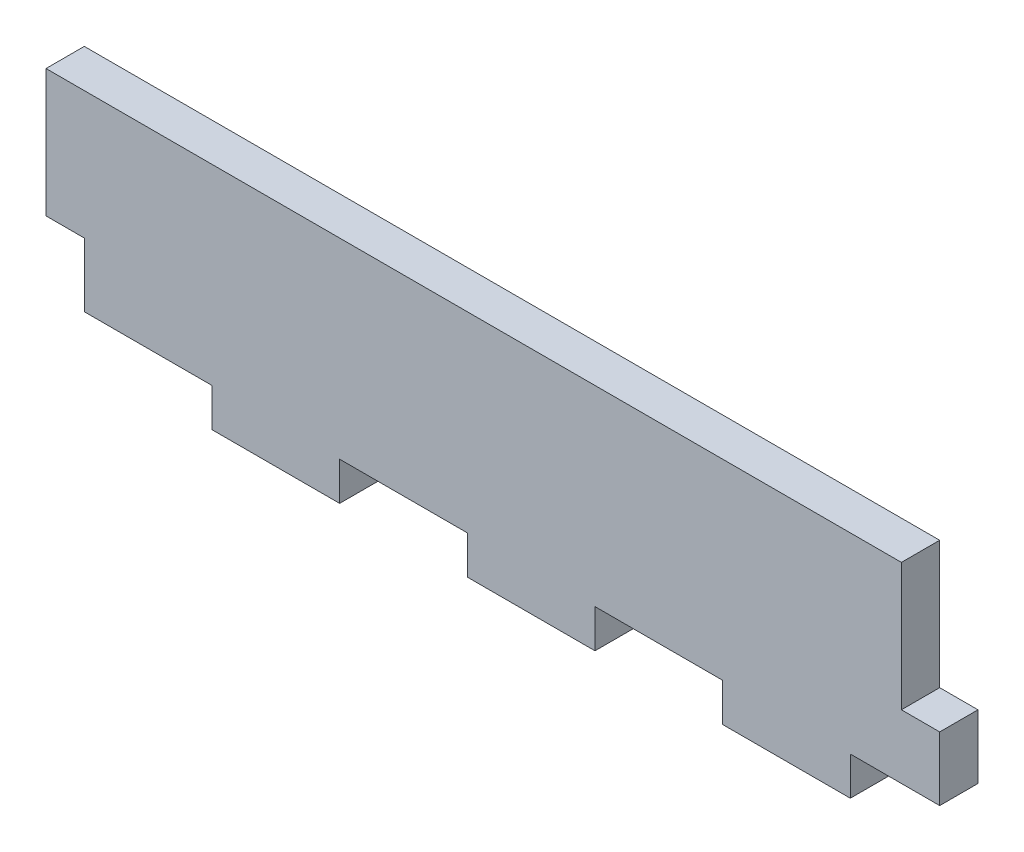
ISO-10303-21;
HEADER;
FILE_DESCRIPTION(('STEP AP214'),'2;1');
FILE_NAME('part.step','',(''),(''),'','','');
FILE_SCHEMA(('AUTOMOTIVE_DESIGN { 1 0 10303 214 1 1 1 1 }'));
ENDSEC;
DATA;
#1=APPLICATION_CONTEXT('core data for automotive mechanical design processes');
#2=APPLICATION_PROTOCOL_DEFINITION('international standard','automotive_design',2000,#1);
#3=PRODUCT_CONTEXT('',#1,'mechanical');
#4=PRODUCT('Part','Part','',(#3));
#5=PRODUCT_RELATED_PRODUCT_CATEGORY('part','',(#4));
#6=PRODUCT_DEFINITION_FORMATION('','',#4);
#7=PRODUCT_DEFINITION_CONTEXT('part definition',#1,'design');
#8=PRODUCT_DEFINITION('design','',#6,#7);
#9=PRODUCT_DEFINITION_SHAPE('','',#8);
#10=(LENGTH_UNIT() NAMED_UNIT(*) SI_UNIT(.MILLI.,.METRE.));
#11=(NAMED_UNIT(*) PLANE_ANGLE_UNIT() SI_UNIT($,.RADIAN.));
#12=(NAMED_UNIT(*) SI_UNIT($,.STERADIAN.) SOLID_ANGLE_UNIT());
#13=UNCERTAINTY_MEASURE_WITH_UNIT(LENGTH_MEASURE(1.E-05),#10,'distance_accuracy_value','');
#14=(GEOMETRIC_REPRESENTATION_CONTEXT(3) GLOBAL_UNCERTAINTY_ASSIGNED_CONTEXT((#13)) GLOBAL_UNIT_ASSIGNED_CONTEXT((#10,
#11,#12)) REPRESENTATION_CONTEXT('',''));
#15=CARTESIAN_POINT('',(0.,0.,0.));
#16=DIRECTION('',(0.,0.,1.));
#17=DIRECTION('',(1.,0.,0.));
#18=AXIS2_PLACEMENT_3D('',#15,#16,#17);
#19=CARTESIAN_POINT('',(0.,0.,3.));
#20=DIRECTION('',(1.,0.,0.));
#21=DIRECTION('',(0.,1.,0.));
#22=AXIS2_PLACEMENT_3D('',#19,#20,#21);
#23=PLANE('',#22);
#24=DIRECTION('',(0.,0.,1.));
#25=VECTOR('',#24,1.);
#26=CARTESIAN_POINT('',(0.,-10.,0.));
#27=LINE('',#26,#25);
#28=CARTESIAN_POINT('',(0.,-10.,0.));
#29=VERTEX_POINT('',#28);
#30=CARTESIAN_POINT('',(0.,-10.,3.));
#31=VERTEX_POINT('',#30);
#32=EDGE_CURVE('E47',#29,#31,#27,.T.);
#33=ORIENTED_EDGE('',*,*,#32,.F.);
#34=DIRECTION('',(0.,-1.,0.));
#35=VECTOR('',#34,1.);
#36=CARTESIAN_POINT('',(0.,0.,0.));
#37=LINE('',#36,#35);
#38=CARTESIAN_POINT('',(0.,-15.,0.));
#39=VERTEX_POINT('',#38);
#40=EDGE_CURVE('E193',#29,#39,#37,.T.);
#41=ORIENTED_EDGE('',*,*,#40,.T.);
#42=DIRECTION('',(0.,0.,1.));
#43=VECTOR('',#42,1.);
#44=CARTESIAN_POINT('',(0.,-15.,-7.));
#45=LINE('',#44,#43);
#46=CARTESIAN_POINT('',(0.,-15.,3.));
#47=VERTEX_POINT('',#46);
#48=EDGE_CURVE('E262',#39,#47,#45,.T.);
#49=ORIENTED_EDGE('',*,*,#48,.T.);
#50=DIRECTION('',(0.,-1.,0.));
#51=VECTOR('',#50,1.);
#52=CARTESIAN_POINT('',(0.,0.,3.));
#53=LINE('',#52,#51);
#54=EDGE_CURVE('E268',#31,#47,#53,.T.);
#55=ORIENTED_EDGE('',*,*,#54,.F.);
#56=EDGE_LOOP('',(#33,#41,#49,#55));
#57=FACE_BOUND('',#56,.T.);
#58=ADVANCED_FACE('F33',(#57),#23,.F.);
#59=CARTESIAN_POINT('',(0.,-18.,3.));
#60=DIRECTION('',(0.,1.,0.));
#61=DIRECTION('',(0.,0.,1.));
#62=AXIS2_PLACEMENT_3D('',#59,#60,#61);
#63=PLANE('',#62);
#64=DIRECTION('',(1.,0.,0.));
#65=VECTOR('',#64,1.);
#66=CARTESIAN_POINT('',(0.,-18.,0.));
#67=LINE('',#66,#65);
#68=CARTESIAN_POINT('',(10.,-18.,0.));
#69=VERTEX_POINT('',#68);
#70=CARTESIAN_POINT('',(20.,-18.,0.));
#71=VERTEX_POINT('',#70);
#72=EDGE_CURVE('E284',#69,#71,#67,.T.);
#73=ORIENTED_EDGE('',*,*,#72,.T.);
#74=DIRECTION('',(0.,0.,1.));
#75=VECTOR('',#74,1.);
#76=CARTESIAN_POINT('',(20.,-18.,-7.));
#77=LINE('',#76,#75);
#78=CARTESIAN_POINT('',(20.,-18.,3.));
#79=VERTEX_POINT('',#78);
#80=EDGE_CURVE('E218',#71,#79,#77,.T.);
#81=ORIENTED_EDGE('',*,*,#80,.T.);
#82=DIRECTION('',(1.,0.,0.));
#83=VECTOR('',#82,1.);
#84=CARTESIAN_POINT('',(0.,-18.,3.));
#85=LINE('',#84,#83);
#86=CARTESIAN_POINT('',(10.,-18.,3.));
#87=VERTEX_POINT('',#86);
#88=EDGE_CURVE('E272',#87,#79,#85,.T.);
#89=ORIENTED_EDGE('',*,*,#88,.F.);
#90=DIRECTION('',(0.,0.,1.));
#91=VECTOR('',#90,1.);
#92=CARTESIAN_POINT('',(10.,-18.,-7.));
#93=LINE('',#92,#91);
#94=EDGE_CURVE('E261',#69,#87,#93,.T.);
#95=ORIENTED_EDGE('',*,*,#94,.F.);
#96=EDGE_LOOP('',(#73,#81,#89,#95));
#97=FACE_BOUND('',#96,.T.);
#98=ADVANCED_FACE('F338',(#97),#63,.F.);
#99=CARTESIAN_POINT('',(30.,-18.,3.));
#100=VERTEX_POINT('',#99);
#101=CARTESIAN_POINT('',(40.,-18.,3.));
#102=VERTEX_POINT('',#101);
#103=EDGE_CURVE('E276',#100,#102,#85,.T.);
#104=ORIENTED_EDGE('',*,*,#103,.F.);
#105=DIRECTION('',(0.,0.,1.));
#106=VECTOR('',#105,1.);
#107=CARTESIAN_POINT('',(30.,-18.,-7.));
#108=LINE('',#107,#106);
#109=CARTESIAN_POINT('',(30.,-18.,0.));
#110=VERTEX_POINT('',#109);
#111=EDGE_CURVE('E224',#110,#100,#108,.T.);
#112=ORIENTED_EDGE('',*,*,#111,.F.);
#113=CARTESIAN_POINT('',(40.,-18.,0.));
#114=VERTEX_POINT('',#113);
#115=EDGE_CURVE('E288',#110,#114,#67,.T.);
#116=ORIENTED_EDGE('',*,*,#115,.T.);
#117=DIRECTION('',(0.,0.,1.));
#118=VECTOR('',#117,1.);
#119=CARTESIAN_POINT('',(40.,-18.,-7.));
#120=LINE('',#119,#118);
#121=EDGE_CURVE('E237',#114,#102,#120,.T.);
#122=ORIENTED_EDGE('',*,*,#121,.T.);
#123=EDGE_LOOP('',(#104,#112,#116,#122));
#124=FACE_BOUND('',#123,.T.);
#125=ADVANCED_FACE('F342',(#124),#63,.F.);
#126=CARTESIAN_POINT('',(50.,-18.,3.));
#127=VERTEX_POINT('',#126);
#128=CARTESIAN_POINT('',(60.,-18.,3.));
#129=VERTEX_POINT('',#128);
#130=EDGE_CURVE('E270',#127,#129,#85,.T.);
#131=ORIENTED_EDGE('',*,*,#130,.F.);
#132=DIRECTION('',(0.,0.,1.));
#133=VECTOR('',#132,1.);
#134=CARTESIAN_POINT('',(50.,-18.,-7.));
#135=LINE('',#134,#133);
#136=CARTESIAN_POINT('',(50.,-18.,0.));
#137=VERTEX_POINT('',#136);
#138=EDGE_CURVE('E241',#137,#127,#135,.T.);
#139=ORIENTED_EDGE('',*,*,#138,.F.);
#140=CARTESIAN_POINT('',(60.,-18.,0.));
#141=VERTEX_POINT('',#140);
#142=EDGE_CURVE('E283',#137,#141,#67,.T.);
#143=ORIENTED_EDGE('',*,*,#142,.T.);
#144=DIRECTION('',(0.,0.,1.));
#145=VECTOR('',#144,1.);
#146=CARTESIAN_POINT('',(60.,-18.,-7.));
#147=LINE('',#146,#145);
#148=EDGE_CURVE('E249',#141,#129,#147,.T.);
#149=ORIENTED_EDGE('',*,*,#148,.T.);
#150=EDGE_LOOP('',(#131,#139,#143,#149));
#151=FACE_BOUND('',#150,.T.);
#152=ADVANCED_FACE('F344',(#151),#63,.F.);
#153=CARTESIAN_POINT('',(67.,0.,3.));
#154=DIRECTION('',(-1.,0.,0.));
#155=DIRECTION('',(0.,0.,1.));
#156=AXIS2_PLACEMENT_3D('',#153,#154,#155);
#157=PLANE('',#156);
#158=DIRECTION('',(0.,1.,0.));
#159=VECTOR('',#158,1.);
#160=CARTESIAN_POINT('',(67.,0.,0.));
#161=LINE('',#160,#159);
#162=CARTESIAN_POINT('',(67.,-15.,0.));
#163=VERTEX_POINT('',#162);
#164=CARTESIAN_POINT('',(67.,-10.,0.));
#165=VERTEX_POINT('',#164);
#166=EDGE_CURVE('E287',#163,#165,#161,.T.);
#167=ORIENTED_EDGE('',*,*,#166,.T.);
#168=DIRECTION('',(0.,0.,1.));
#169=VECTOR('',#168,1.);
#170=CARTESIAN_POINT('',(67.,-10.,-7.));
#171=LINE('',#170,#169);
#172=CARTESIAN_POINT('',(67.,-10.,3.));
#173=VERTEX_POINT('',#172);
#174=EDGE_CURVE('E203',#165,#173,#171,.T.);
#175=ORIENTED_EDGE('',*,*,#174,.T.);
#176=DIRECTION('',(0.,1.,0.));
#177=VECTOR('',#176,1.);
#178=CARTESIAN_POINT('',(67.,0.,3.));
#179=LINE('',#178,#177);
#180=CARTESIAN_POINT('',(67.,-15.,3.));
#181=VERTEX_POINT('',#180);
#182=EDGE_CURVE('E275',#181,#173,#179,.T.);
#183=ORIENTED_EDGE('',*,*,#182,.F.);
#184=DIRECTION('',(0.,0.,-1.));
#185=VECTOR('',#184,1.);
#186=CARTESIAN_POINT('',(67.,-15.,3.));
#187=LINE('',#186,#185);
#188=EDGE_CURVE('E221',#181,#163,#187,.T.);
#189=ORIENTED_EDGE('',*,*,#188,.T.);
#190=EDGE_LOOP('',(#167,#175,#183,#189));
#191=FACE_BOUND('',#190,.T.);
#192=ADVANCED_FACE('F351',(#191),#157,.F.);
#193=CARTESIAN_POINT('',(0.,0.,3.));
#194=DIRECTION('',(0.,-1.,0.));
#195=DIRECTION('',(0.,0.,-1.));
#196=AXIS2_PLACEMENT_3D('',#193,#194,#195);
#197=PLANE('',#196);
#198=DIRECTION('',(-1.,0.,0.));
#199=VECTOR('',#198,1.);
#200=CARTESIAN_POINT('',(0.,0.,3.));
#201=LINE('',#200,#199);
#202=CARTESIAN_POINT('',(64.,0.,3.));
#203=VERTEX_POINT('',#202);
#204=CARTESIAN_POINT('',(-3.,0.,3.));
#205=VERTEX_POINT('',#204);
#206=EDGE_CURVE('E279',#203,#205,#201,.T.);
#207=ORIENTED_EDGE('',*,*,#206,.F.);
#208=DIRECTION('',(0.,0.,1.));
#209=VECTOR('',#208,1.);
#210=CARTESIAN_POINT('',(64.,0.,-7.));
#211=LINE('',#210,#209);
#212=CARTESIAN_POINT('',(64.,0.,0.));
#213=VERTEX_POINT('',#212);
#214=EDGE_CURVE('E202',#213,#203,#211,.T.);
#215=ORIENTED_EDGE('',*,*,#214,.F.);
#216=DIRECTION('',(-1.,0.,0.));
#217=VECTOR('',#216,1.);
#218=CARTESIAN_POINT('',(0.,0.,0.));
#219=LINE('',#218,#217);
#220=CARTESIAN_POINT('',(-3.,0.,0.));
#221=VERTEX_POINT('',#220);
#222=EDGE_CURVE('E271',#213,#221,#219,.T.);
#223=ORIENTED_EDGE('',*,*,#222,.T.);
#224=DIRECTION('',(0.,0.,-1.));
#225=VECTOR('',#224,1.);
#226=CARTESIAN_POINT('',(-3.,0.,0.));
#227=LINE('',#226,#225);
#228=EDGE_CURVE('E186',#205,#221,#227,.T.);
#229=ORIENTED_EDGE('',*,*,#228,.F.);
#230=EDGE_LOOP('',(#207,#215,#223,#229));
#231=FACE_BOUND('',#230,.T.);
#232=ADVANCED_FACE('F325',(#231),#197,.F.);
#233=CARTESIAN_POINT('',(0.,0.,3.));
#234=DIRECTION('',(0.,0.,1.));
#235=DIRECTION('',(1.,0.,0.));
#236=AXIS2_PLACEMENT_3D('',#233,#234,#235);
#237=PLANE('',#236);
#238=DIRECTION('',(1.,0.,0.));
#239=VECTOR('',#238,1.);
#240=CARTESIAN_POINT('',(67.,-10.,3.));
#241=LINE('',#240,#239);
#242=CARTESIAN_POINT('',(64.,-10.,3.));
#243=VERTEX_POINT('',#242);
#244=EDGE_CURVE('E196',#243,#173,#241,.T.);
#245=ORIENTED_EDGE('',*,*,#244,.F.);
#246=DIRECTION('',(0.,-1.,0.));
#247=VECTOR('',#246,1.);
#248=CARTESIAN_POINT('',(64.,0.,3.));
#249=LINE('',#248,#247);
#250=EDGE_CURVE('E194',#203,#243,#249,.T.);
#251=ORIENTED_EDGE('',*,*,#250,.F.);
#252=ORIENTED_EDGE('',*,*,#206,.T.);
#253=DIRECTION('',(0.,1.,0.));
#254=VECTOR('',#253,1.);
#255=CARTESIAN_POINT('',(-3.,0.,3.));
#256=LINE('',#255,#254);
#257=CARTESIAN_POINT('',(-3.,-10.,3.));
#258=VERTEX_POINT('',#257);
#259=EDGE_CURVE('E179',#258,#205,#256,.T.);
#260=ORIENTED_EDGE('',*,*,#259,.F.);
#261=DIRECTION('',(1.,0.,0.));
#262=VECTOR('',#261,1.);
#263=CARTESIAN_POINT('',(-3.,-10.,3.));
#264=LINE('',#263,#262);
#265=EDGE_CURVE('E175',#258,#31,#264,.T.);
#266=ORIENTED_EDGE('',*,*,#265,.T.);
#267=ORIENTED_EDGE('',*,*,#54,.T.);
#268=DIRECTION('',(-1.,0.,0.));
#269=VECTOR('',#268,1.);
#270=CARTESIAN_POINT('',(0.,-15.,3.));
#271=LINE('',#270,#269);
#272=CARTESIAN_POINT('',(10.,-15.,3.));
#273=VERTEX_POINT('',#272);
#274=EDGE_CURVE('E258',#273,#47,#271,.T.);
#275=ORIENTED_EDGE('',*,*,#274,.F.);
#276=DIRECTION('',(0.,1.,0.));
#277=VECTOR('',#276,1.);
#278=CARTESIAN_POINT('',(10.,-18.,3.));
#279=LINE('',#278,#277);
#280=EDGE_CURVE('E255',#87,#273,#279,.T.);
#281=ORIENTED_EDGE('',*,*,#280,.F.);
#282=ORIENTED_EDGE('',*,*,#88,.T.);
#283=DIRECTION('',(0.,-1.,0.));
#284=VECTOR('',#283,1.);
#285=CARTESIAN_POINT('',(20.,-18.,3.));
#286=LINE('',#285,#284);
#287=CARTESIAN_POINT('',(20.,-15.,3.));
#288=VERTEX_POINT('',#287);
#289=EDGE_CURVE('E209',#288,#79,#286,.T.);
#290=ORIENTED_EDGE('',*,*,#289,.F.);
#291=DIRECTION('',(-1.,0.,0.));
#292=VECTOR('',#291,1.);
#293=CARTESIAN_POINT('',(20.,-15.,3.));
#294=LINE('',#293,#292);
#295=CARTESIAN_POINT('',(30.,-15.,3.));
#296=VERTEX_POINT('',#295);
#297=EDGE_CURVE('E215',#296,#288,#294,.T.);
#298=ORIENTED_EDGE('',*,*,#297,.F.);
#299=DIRECTION('',(0.,1.,0.));
#300=VECTOR('',#299,1.);
#301=CARTESIAN_POINT('',(30.,-18.,3.));
#302=LINE('',#301,#300);
#303=EDGE_CURVE('E211',#100,#296,#302,.T.);
#304=ORIENTED_EDGE('',*,*,#303,.F.);
#305=ORIENTED_EDGE('',*,*,#103,.T.);
#306=DIRECTION('',(0.,-1.,0.));
#307=VECTOR('',#306,1.);
#308=CARTESIAN_POINT('',(40.,-18.,3.));
#309=LINE('',#308,#307);
#310=CARTESIAN_POINT('',(40.,-15.,3.));
#311=VERTEX_POINT('',#310);
#312=EDGE_CURVE('E228',#311,#102,#309,.T.);
#313=ORIENTED_EDGE('',*,*,#312,.F.);
#314=DIRECTION('',(-1.,0.,0.));
#315=VECTOR('',#314,1.);
#316=CARTESIAN_POINT('',(40.,-15.,3.));
#317=LINE('',#316,#315);
#318=CARTESIAN_POINT('',(50.,-15.,3.));
#319=VERTEX_POINT('',#318);
#320=EDGE_CURVE('E234',#319,#311,#317,.T.);
#321=ORIENTED_EDGE('',*,*,#320,.F.);
#322=DIRECTION('',(0.,1.,0.));
#323=VECTOR('',#322,1.);
#324=CARTESIAN_POINT('',(50.,-18.,3.));
#325=LINE('',#324,#323);
#326=EDGE_CURVE('E230',#127,#319,#325,.T.);
#327=ORIENTED_EDGE('',*,*,#326,.F.);
#328=ORIENTED_EDGE('',*,*,#130,.T.);
#329=DIRECTION('',(0.,-1.,0.));
#330=VECTOR('',#329,1.);
#331=CARTESIAN_POINT('',(60.,-18.,3.));
#332=LINE('',#331,#330);
#333=CARTESIAN_POINT('',(60.,-15.,3.));
#334=VERTEX_POINT('',#333);
#335=EDGE_CURVE('E206',#334,#129,#332,.T.);
#336=ORIENTED_EDGE('',*,*,#335,.F.);
#337=DIRECTION('',(-1.,0.,0.));
#338=VECTOR('',#337,1.);
#339=CARTESIAN_POINT('',(60.,-15.,3.));
#340=LINE('',#339,#338);
#341=EDGE_CURVE('E246',#181,#334,#340,.T.);
#342=ORIENTED_EDGE('',*,*,#341,.F.);
#343=ORIENTED_EDGE('',*,*,#182,.T.);
#344=EDGE_LOOP('',(#245,#251,#252,#260,#266,#267,#275,#281,#282,#290,#298,#304,#305,#313,#321,
#327,#328,#336,#342,#343));
#345=FACE_BOUND('',#344,.T.);
#346=ADVANCED_FACE('F328',(#345),#237,.T.);
#347=CARTESIAN_POINT('',(0.,0.,0.));
#348=DIRECTION('',(0.,0.,1.));
#349=DIRECTION('',(1.,0.,0.));
#350=AXIS2_PLACEMENT_3D('',#347,#348,#349);
#351=PLANE('',#350);
#352=DIRECTION('',(0.,-1.,0.));
#353=VECTOR('',#352,1.);
#354=CARTESIAN_POINT('',(64.,0.,0.));
#355=LINE('',#354,#353);
#356=CARTESIAN_POINT('',(64.,-10.,0.));
#357=VERTEX_POINT('',#356);
#358=EDGE_CURVE('E40',#213,#357,#355,.T.);
#359=ORIENTED_EDGE('',*,*,#358,.T.);
#360=DIRECTION('',(1.,0.,0.));
#361=VECTOR('',#360,1.);
#362=CARTESIAN_POINT('',(0.,-10.,0.));
#363=LINE('',#362,#361);
#364=EDGE_CURVE('E11',#357,#165,#363,.T.);
#365=ORIENTED_EDGE('',*,*,#364,.T.);
#366=ORIENTED_EDGE('',*,*,#166,.F.);
#367=DIRECTION('',(-1.,0.,0.));
#368=VECTOR('',#367,1.);
#369=CARTESIAN_POINT('',(0.,-15.,0.));
#370=LINE('',#369,#368);
#371=CARTESIAN_POINT('',(60.,-15.,0.));
#372=VERTEX_POINT('',#371);
#373=EDGE_CURVE('E296',#163,#372,#370,.T.);
#374=ORIENTED_EDGE('',*,*,#373,.T.);
#375=DIRECTION('',(0.,-1.,0.));
#376=VECTOR('',#375,1.);
#377=CARTESIAN_POINT('',(60.,0.,0.));
#378=LINE('',#377,#376);
#379=EDGE_CURVE('E299',#372,#141,#378,.T.);
#380=ORIENTED_EDGE('',*,*,#379,.T.);
#381=ORIENTED_EDGE('',*,*,#142,.F.);
#382=DIRECTION('',(0.,1.,0.));
#383=VECTOR('',#382,1.);
#384=CARTESIAN_POINT('',(50.,0.,0.));
#385=LINE('',#384,#383);
#386=CARTESIAN_POINT('',(50.,-15.,0.));
#387=VERTEX_POINT('',#386);
#388=EDGE_CURVE('E302',#137,#387,#385,.T.);
#389=ORIENTED_EDGE('',*,*,#388,.T.);
#390=DIRECTION('',(-1.,0.,0.));
#391=VECTOR('',#390,1.);
#392=CARTESIAN_POINT('',(0.,-15.,0.));
#393=LINE('',#392,#391);
#394=CARTESIAN_POINT('',(40.,-15.,0.));
#395=VERTEX_POINT('',#394);
#396=EDGE_CURVE('E305',#387,#395,#393,.T.);
#397=ORIENTED_EDGE('',*,*,#396,.T.);
#398=DIRECTION('',(0.,-1.,0.));
#399=VECTOR('',#398,1.);
#400=CARTESIAN_POINT('',(40.,0.,0.));
#401=LINE('',#400,#399);
#402=EDGE_CURVE('E308',#395,#114,#401,.T.);
#403=ORIENTED_EDGE('',*,*,#402,.T.);
#404=ORIENTED_EDGE('',*,*,#115,.F.);
#405=DIRECTION('',(0.,1.,0.));
#406=VECTOR('',#405,1.);
#407=CARTESIAN_POINT('',(30.,0.,0.));
#408=LINE('',#407,#406);
#409=CARTESIAN_POINT('',(30.,-15.,0.));
#410=VERTEX_POINT('',#409);
#411=EDGE_CURVE('E311',#110,#410,#408,.T.);
#412=ORIENTED_EDGE('',*,*,#411,.T.);
#413=DIRECTION('',(-1.,0.,0.));
#414=VECTOR('',#413,1.);
#415=CARTESIAN_POINT('',(0.,-15.,0.));
#416=LINE('',#415,#414);
#417=CARTESIAN_POINT('',(20.,-15.,0.));
#418=VERTEX_POINT('',#417);
#419=EDGE_CURVE('E314',#410,#418,#416,.T.);
#420=ORIENTED_EDGE('',*,*,#419,.T.);
#421=DIRECTION('',(0.,-1.,0.));
#422=VECTOR('',#421,1.);
#423=CARTESIAN_POINT('',(20.,0.,0.));
#424=LINE('',#423,#422);
#425=EDGE_CURVE('E317',#418,#71,#424,.T.);
#426=ORIENTED_EDGE('',*,*,#425,.T.);
#427=ORIENTED_EDGE('',*,*,#72,.F.);
#428=DIRECTION('',(0.,1.,0.));
#429=VECTOR('',#428,1.);
#430=CARTESIAN_POINT('',(10.,0.,0.));
#431=LINE('',#430,#429);
#432=CARTESIAN_POINT('',(10.,-15.,0.));
#433=VERTEX_POINT('',#432);
#434=EDGE_CURVE('E281',#69,#433,#431,.T.);
#435=ORIENTED_EDGE('',*,*,#434,.T.);
#436=DIRECTION('',(-1.,0.,0.));
#437=VECTOR('',#436,1.);
#438=CARTESIAN_POINT('',(0.,-15.,0.));
#439=LINE('',#438,#437);
#440=EDGE_CURVE('E294',#433,#39,#439,.T.);
#441=ORIENTED_EDGE('',*,*,#440,.T.);
#442=ORIENTED_EDGE('',*,*,#40,.F.);
#443=DIRECTION('',(1.,0.,0.));
#444=VECTOR('',#443,1.);
#445=CARTESIAN_POINT('',(-3.,-10.,0.));
#446=LINE('',#445,#444);
#447=CARTESIAN_POINT('',(-3.,-10.,0.));
#448=VERTEX_POINT('',#447);
#449=EDGE_CURVE('E173',#448,#29,#446,.T.);
#450=ORIENTED_EDGE('',*,*,#449,.F.);
#451=DIRECTION('',(0.,-1.,0.));
#452=VECTOR('',#451,1.);
#453=CARTESIAN_POINT('',(-3.,0.,0.));
#454=LINE('',#453,#452);
#455=EDGE_CURVE('E180',#221,#448,#454,.T.);
#456=ORIENTED_EDGE('',*,*,#455,.F.);
#457=ORIENTED_EDGE('',*,*,#222,.F.);
#458=EDGE_LOOP('',(#359,#365,#366,#374,#380,#381,#389,#397,#403,#404,#412,#420,#426,#427,#435,
#441,#442,#450,#456,#457));
#459=FACE_BOUND('',#458,.T.);
#460=ADVANCED_FACE('F191',(#459),#351,.F.);
#461=CARTESIAN_POINT('',(0.,-15.,-7.));
#462=DIRECTION('',(0.,1.,0.));
#463=DIRECTION('',(0.,0.,1.));
#464=AXIS2_PLACEMENT_3D('',#461,#462,#463);
#465=PLANE('',#464);
#466=DIRECTION('',(0.,0.,1.));
#467=VECTOR('',#466,1.);
#468=CARTESIAN_POINT('',(10.,-15.,-7.));
#469=LINE('',#468,#467);
#470=EDGE_CURVE('E265',#433,#273,#469,.T.);
#471=ORIENTED_EDGE('',*,*,#470,.T.);
#472=ORIENTED_EDGE('',*,*,#274,.T.);
#473=ORIENTED_EDGE('',*,*,#48,.F.);
#474=ORIENTED_EDGE('',*,*,#440,.F.);
#475=EDGE_LOOP('',(#471,#472,#473,#474));
#476=FACE_BOUND('',#475,.T.);
#477=ADVANCED_FACE('F335',(#476),#465,.F.);
#478=CARTESIAN_POINT('',(10.,-18.,-7.));
#479=DIRECTION('',(1.,0.,0.));
#480=DIRECTION('',(0.,0.,-1.));
#481=AXIS2_PLACEMENT_3D('',#478,#479,#480);
#482=PLANE('',#481);
#483=ORIENTED_EDGE('',*,*,#94,.T.);
#484=ORIENTED_EDGE('',*,*,#280,.T.);
#485=ORIENTED_EDGE('',*,*,#470,.F.);
#486=ORIENTED_EDGE('',*,*,#434,.F.);
#487=EDGE_LOOP('',(#483,#484,#485,#486));
#488=FACE_BOUND('',#487,.T.);
#489=ADVANCED_FACE('F402',(#488),#482,.F.);
#490=CARTESIAN_POINT('',(60.,-18.,-7.));
#491=DIRECTION('',(-1.,0.,0.));
#492=DIRECTION('',(0.,-1.,0.));
#493=AXIS2_PLACEMENT_3D('',#490,#491,#492);
#494=PLANE('',#493);
#495=DIRECTION('',(0.,0.,1.));
#496=VECTOR('',#495,1.);
#497=CARTESIAN_POINT('',(60.,-15.,-7.));
#498=LINE('',#497,#496);
#499=EDGE_CURVE('E231',#372,#334,#498,.T.);
#500=ORIENTED_EDGE('',*,*,#499,.T.);
#501=ORIENTED_EDGE('',*,*,#335,.T.);
#502=ORIENTED_EDGE('',*,*,#148,.F.);
#503=ORIENTED_EDGE('',*,*,#379,.F.);
#504=EDGE_LOOP('',(#500,#501,#502,#503));
#505=FACE_BOUND('',#504,.T.);
#506=ADVANCED_FACE('F398',(#505),#494,.F.);
#507=CARTESIAN_POINT('',(60.,-15.,-7.));
#508=DIRECTION('',(0.,1.,0.));
#509=DIRECTION('',(0.,0.,1.));
#510=AXIS2_PLACEMENT_3D('',#507,#508,#509);
#511=PLANE('',#510);
#512=ORIENTED_EDGE('',*,*,#341,.T.);
#513=ORIENTED_EDGE('',*,*,#499,.F.);
#514=ORIENTED_EDGE('',*,*,#373,.F.);
#515=ORIENTED_EDGE('',*,*,#188,.F.);
#516=EDGE_LOOP('',(#512,#513,#514,#515));
#517=FACE_BOUND('',#516,.T.);
#518=ADVANCED_FACE('F395',(#517),#511,.F.);
#519=CARTESIAN_POINT('',(40.,-18.,-7.));
#520=DIRECTION('',(-1.,0.,0.));
#521=DIRECTION('',(0.,-1.,0.));
#522=AXIS2_PLACEMENT_3D('',#519,#520,#521);
#523=PLANE('',#522);
#524=DIRECTION('',(0.,0.,1.));
#525=VECTOR('',#524,1.);
#526=CARTESIAN_POINT('',(40.,-15.,-7.));
#527=LINE('',#526,#525);
#528=EDGE_CURVE('E212',#395,#311,#527,.T.);
#529=ORIENTED_EDGE('',*,*,#528,.T.);
#530=ORIENTED_EDGE('',*,*,#312,.T.);
#531=ORIENTED_EDGE('',*,*,#121,.F.);
#532=ORIENTED_EDGE('',*,*,#402,.F.);
#533=EDGE_LOOP('',(#529,#530,#531,#532));
#534=FACE_BOUND('',#533,.T.);
#535=ADVANCED_FACE('F374',(#534),#523,.F.);
#536=CARTESIAN_POINT('',(40.,-15.,-7.));
#537=DIRECTION('',(0.,1.,0.));
#538=DIRECTION('',(0.,0.,1.));
#539=AXIS2_PLACEMENT_3D('',#536,#537,#538);
#540=PLANE('',#539);
#541=DIRECTION('',(0.,0.,1.));
#542=VECTOR('',#541,1.);
#543=CARTESIAN_POINT('',(50.,-15.,-7.));
#544=LINE('',#543,#542);
#545=EDGE_CURVE('E239',#387,#319,#544,.T.);
#546=ORIENTED_EDGE('',*,*,#545,.T.);
#547=ORIENTED_EDGE('',*,*,#320,.T.);
#548=ORIENTED_EDGE('',*,*,#528,.F.);
#549=ORIENTED_EDGE('',*,*,#396,.F.);
#550=EDGE_LOOP('',(#546,#547,#548,#549));
#551=FACE_BOUND('',#550,.T.);
#552=ADVANCED_FACE('F378',(#551),#540,.F.);
#553=CARTESIAN_POINT('',(50.,-18.,-7.));
#554=DIRECTION('',(1.,0.,0.));
#555=DIRECTION('',(0.,0.,-1.));
#556=AXIS2_PLACEMENT_3D('',#553,#554,#555);
#557=PLANE('',#556);
#558=ORIENTED_EDGE('',*,*,#138,.T.);
#559=ORIENTED_EDGE('',*,*,#326,.T.);
#560=ORIENTED_EDGE('',*,*,#545,.F.);
#561=ORIENTED_EDGE('',*,*,#388,.F.);
#562=EDGE_LOOP('',(#558,#559,#560,#561));
#563=FACE_BOUND('',#562,.T.);
#564=ADVANCED_FACE('F380',(#563),#557,.F.);
#565=CARTESIAN_POINT('',(20.,-18.,-7.));
#566=DIRECTION('',(-1.,0.,0.));
#567=DIRECTION('',(0.,-1.,0.));
#568=AXIS2_PLACEMENT_3D('',#565,#566,#567);
#569=PLANE('',#568);
#570=DIRECTION('',(0.,0.,1.));
#571=VECTOR('',#570,1.);
#572=CARTESIAN_POINT('',(20.,-15.,-7.));
#573=LINE('',#572,#571);
#574=EDGE_CURVE('E219',#418,#288,#573,.T.);
#575=ORIENTED_EDGE('',*,*,#574,.T.);
#576=ORIENTED_EDGE('',*,*,#289,.T.);
#577=ORIENTED_EDGE('',*,*,#80,.F.);
#578=ORIENTED_EDGE('',*,*,#425,.F.);
#579=EDGE_LOOP('',(#575,#576,#577,#578));
#580=FACE_BOUND('',#579,.T.);
#581=ADVANCED_FACE('F382',(#580),#569,.F.);
#582=CARTESIAN_POINT('',(20.,-15.,-7.));
#583=DIRECTION('',(0.,1.,0.));
#584=DIRECTION('',(0.,0.,1.));
#585=AXIS2_PLACEMENT_3D('',#582,#583,#584);
#586=PLANE('',#585);
#587=DIRECTION('',(0.,0.,1.));
#588=VECTOR('',#587,1.);
#589=CARTESIAN_POINT('',(30.,-15.,-7.));
#590=LINE('',#589,#588);
#591=EDGE_CURVE('E222',#410,#296,#590,.T.);
#592=ORIENTED_EDGE('',*,*,#591,.T.);
#593=ORIENTED_EDGE('',*,*,#297,.T.);
#594=ORIENTED_EDGE('',*,*,#574,.F.);
#595=ORIENTED_EDGE('',*,*,#419,.F.);
#596=EDGE_LOOP('',(#592,#593,#594,#595));
#597=FACE_BOUND('',#596,.T.);
#598=ADVANCED_FACE('F388',(#597),#586,.F.);
#599=CARTESIAN_POINT('',(30.,-18.,-7.));
#600=DIRECTION('',(1.,0.,0.));
#601=DIRECTION('',(0.,0.,-1.));
#602=AXIS2_PLACEMENT_3D('',#599,#600,#601);
#603=PLANE('',#602);
#604=ORIENTED_EDGE('',*,*,#111,.T.);
#605=ORIENTED_EDGE('',*,*,#303,.T.);
#606=ORIENTED_EDGE('',*,*,#591,.F.);
#607=ORIENTED_EDGE('',*,*,#411,.F.);
#608=EDGE_LOOP('',(#604,#605,#606,#607));
#609=FACE_BOUND('',#608,.T.);
#610=ADVANCED_FACE('F470',(#609),#603,.F.);
#611=CARTESIAN_POINT('',(67.,-10.,-7.));
#612=DIRECTION('',(0.,-1.,0.));
#613=DIRECTION('',(0.,0.,-1.));
#614=AXIS2_PLACEMENT_3D('',#611,#612,#613);
#615=PLANE('',#614);
#616=DIRECTION('',(0.,0.,1.));
#617=VECTOR('',#616,1.);
#618=CARTESIAN_POINT('',(64.,-10.,-7.));
#619=LINE('',#618,#617);
#620=EDGE_CURVE('E55',#357,#243,#619,.T.);
#621=ORIENTED_EDGE('',*,*,#620,.T.);
#622=ORIENTED_EDGE('',*,*,#244,.T.);
#623=ORIENTED_EDGE('',*,*,#174,.F.);
#624=ORIENTED_EDGE('',*,*,#364,.F.);
#625=EDGE_LOOP('',(#621,#622,#623,#624));
#626=FACE_BOUND('',#625,.T.);
#627=ADVANCED_FACE('F479',(#626),#615,.F.);
#628=CARTESIAN_POINT('',(64.,0.,-7.));
#629=DIRECTION('',(-1.,0.,0.));
#630=DIRECTION('',(0.,0.,1.));
#631=AXIS2_PLACEMENT_3D('',#628,#629,#630);
#632=PLANE('',#631);
#633=ORIENTED_EDGE('',*,*,#214,.T.);
#634=ORIENTED_EDGE('',*,*,#250,.T.);
#635=ORIENTED_EDGE('',*,*,#620,.F.);
#636=ORIENTED_EDGE('',*,*,#358,.F.);
#637=EDGE_LOOP('',(#633,#634,#635,#636));
#638=FACE_BOUND('',#637,.T.);
#639=ADVANCED_FACE('F321',(#638),#632,.F.);
#640=CARTESIAN_POINT('',(-3.,-10.,0.));
#641=DIRECTION('',(0.,1.,0.));
#642=DIRECTION('',(-1.,0.,0.));
#643=AXIS2_PLACEMENT_3D('',#640,#641,#642);
#644=PLANE('',#643);
#645=ORIENTED_EDGE('',*,*,#32,.T.);
#646=ORIENTED_EDGE('',*,*,#265,.F.);
#647=DIRECTION('',(0.,0.,1.));
#648=VECTOR('',#647,1.);
#649=CARTESIAN_POINT('',(-3.,-10.,0.));
#650=LINE('',#649,#648);
#651=EDGE_CURVE('E169',#448,#258,#650,.T.);
#652=ORIENTED_EDGE('',*,*,#651,.F.);
#653=ORIENTED_EDGE('',*,*,#449,.T.);
#654=EDGE_LOOP('',(#645,#646,#652,#653));
#655=FACE_BOUND('',#654,.T.);
#656=ADVANCED_FACE('F171',(#655),#644,.F.);
#657=CARTESIAN_POINT('',(-3.,0.,0.));
#658=DIRECTION('',(-1.,0.,0.));
#659=DIRECTION('',(0.,-1.,0.));
#660=AXIS2_PLACEMENT_3D('',#657,#658,#659);
#661=PLANE('',#660);
#662=ORIENTED_EDGE('',*,*,#455,.T.);
#663=ORIENTED_EDGE('',*,*,#651,.T.);
#664=ORIENTED_EDGE('',*,*,#259,.T.);
#665=ORIENTED_EDGE('',*,*,#228,.T.);
#666=EDGE_LOOP('',(#662,#663,#664,#665));
#667=FACE_BOUND('',#666,.T.);
#668=ADVANCED_FACE('F184',(#667),#661,.T.);
#669=CLOSED_SHELL('',(#58,#98,#125,#152,#192,#232,#346,#460,#477,#489,#506,#518,#535,#552,#564,
#581,#598,#610,#627,#639,#656,#668));
#670=MANIFOLD_SOLID_BREP('B2',#669);
#671=ADVANCED_BREP_SHAPE_REPRESENTATION('',(#18,#670),#14);
#672=SHAPE_DEFINITION_REPRESENTATION(#9,#671);
ENDSEC;
END-ISO-10303-21;
